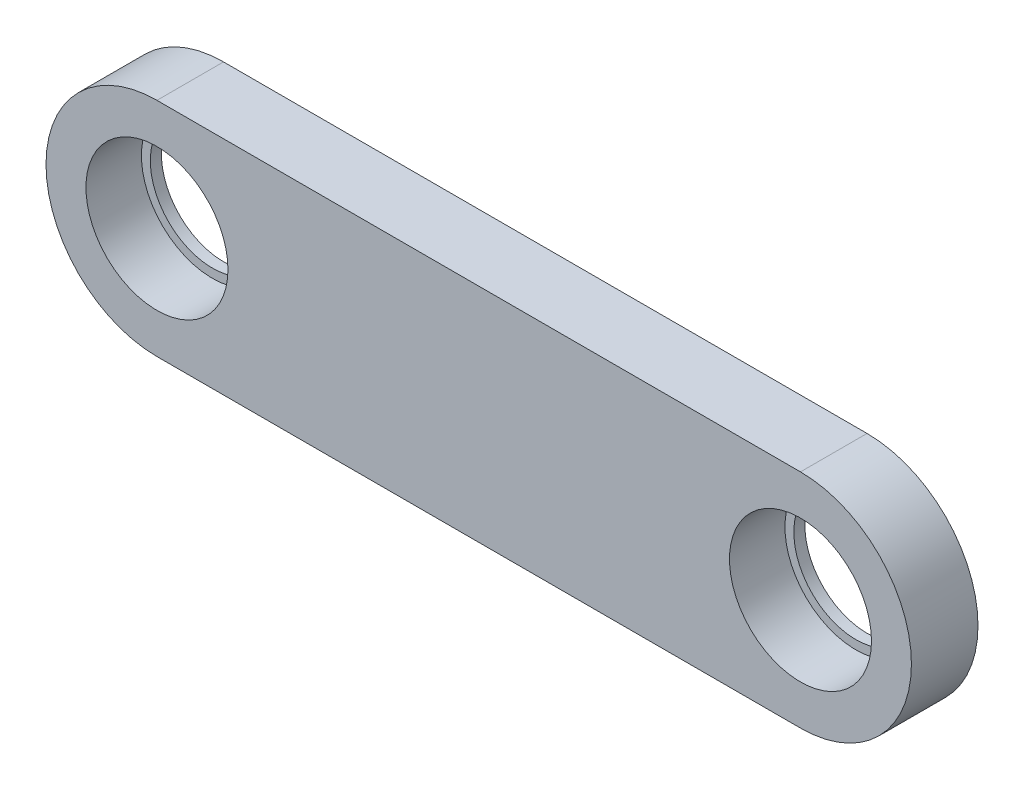
ISO-10303-21;
HEADER;
FILE_DESCRIPTION(('STEP AP214'),'2;1');
FILE_NAME('part.step','',(''),(''),'','','');
FILE_SCHEMA(('AUTOMOTIVE_DESIGN { 1 0 10303 214 1 1 1 1 }'));
ENDSEC;
DATA;
#1=APPLICATION_CONTEXT('core data for automotive mechanical design processes');
#2=APPLICATION_PROTOCOL_DEFINITION('international standard','automotive_design',2000,#1);
#3=PRODUCT_CONTEXT('',#1,'mechanical');
#4=PRODUCT('Part','Part','',(#3));
#5=PRODUCT_RELATED_PRODUCT_CATEGORY('part','',(#4));
#6=PRODUCT_DEFINITION_FORMATION('','',#4);
#7=PRODUCT_DEFINITION_CONTEXT('part definition',#1,'design');
#8=PRODUCT_DEFINITION('design','',#6,#7);
#9=PRODUCT_DEFINITION_SHAPE('','',#8);
#10=(LENGTH_UNIT() NAMED_UNIT(*) SI_UNIT(.MILLI.,.METRE.));
#11=(NAMED_UNIT(*) PLANE_ANGLE_UNIT() SI_UNIT($,.RADIAN.));
#12=(NAMED_UNIT(*) SI_UNIT($,.STERADIAN.) SOLID_ANGLE_UNIT());
#13=UNCERTAINTY_MEASURE_WITH_UNIT(LENGTH_MEASURE(1.E-05),#10,'distance_accuracy_value','');
#14=(GEOMETRIC_REPRESENTATION_CONTEXT(3) GLOBAL_UNCERTAINTY_ASSIGNED_CONTEXT((#13)) GLOBAL_UNIT_ASSIGNED_CONTEXT((#10,
#11,#12)) REPRESENTATION_CONTEXT('',''));
#15=CARTESIAN_POINT('',(0.,0.,0.));
#16=DIRECTION('',(0.,0.,1.));
#17=DIRECTION('',(1.,0.,0.));
#18=AXIS2_PLACEMENT_3D('',#15,#16,#17);
#19=CARTESIAN_POINT('',(-72.5,-1.24222922819225E-13,15.));
#20=DIRECTION('',(0.,0.,-1.));
#21=DIRECTION('',(-1.,0.,0.));
#22=AXIS2_PLACEMENT_3D('',#19,#20,#21);
#23=CYLINDRICAL_SURFACE('',#22,25.);
#24=CARTESIAN_POINT('',(-72.5,-1.24222922819225E-13,0.));
#25=DIRECTION('',(0.,0.,1.));
#26=DIRECTION('',(1.,0.,0.));
#27=AXIS2_PLACEMENT_3D('',#24,#25,#26);
#28=CIRCLE('',#27,25.);
#29=CARTESIAN_POINT('',(-72.5,24.9999999999999,0.));
#30=VERTEX_POINT('',#29);
#31=CARTESIAN_POINT('',(-72.5,-25.0000000000001,0.));
#32=VERTEX_POINT('',#31);
#33=EDGE_CURVE('E102',#30,#32,#28,.T.);
#34=ORIENTED_EDGE('',*,*,#33,.T.);
#35=DIRECTION('',(0.,0.,-1.));
#36=VECTOR('',#35,1.);
#37=CARTESIAN_POINT('',(-72.5,-25.0000000000001,15.));
#38=LINE('',#37,#36);
#39=CARTESIAN_POINT('',(-72.5,-25.0000000000001,15.));
#40=VERTEX_POINT('',#39);
#41=EDGE_CURVE('E11',#40,#32,#38,.T.);
#42=ORIENTED_EDGE('',*,*,#41,.F.);
#43=CARTESIAN_POINT('',(-72.5,-1.24222922819225E-13,15.));
#44=DIRECTION('',(0.,0.,1.));
#45=DIRECTION('',(1.,0.,0.));
#46=AXIS2_PLACEMENT_3D('',#43,#44,#45);
#47=CIRCLE('',#46,25.);
#48=CARTESIAN_POINT('',(-72.5,24.9999999999999,15.));
#49=VERTEX_POINT('',#48);
#50=EDGE_CURVE('E89',#49,#40,#47,.T.);
#51=ORIENTED_EDGE('',*,*,#50,.F.);
#52=DIRECTION('',(0.,0.,-1.));
#53=VECTOR('',#52,1.);
#54=CARTESIAN_POINT('',(-72.5,24.9999999999999,15.));
#55=LINE('',#54,#53);
#56=EDGE_CURVE('E98',#49,#30,#55,.T.);
#57=ORIENTED_EDGE('',*,*,#56,.T.);
#58=EDGE_LOOP('',(#34,#42,#51,#57));
#59=FACE_BOUND('',#58,.T.);
#60=ADVANCED_FACE('F36',(#59),#23,.T.);
#61=CARTESIAN_POINT('',(-72.5,-25.0000000000001,15.));
#62=DIRECTION('',(0.,1.,0.));
#63=DIRECTION('',(0.,0.,1.));
#64=AXIS2_PLACEMENT_3D('',#61,#62,#63);
#65=PLANE('',#64);
#66=DIRECTION('',(1.,0.,0.));
#67=VECTOR('',#66,1.);
#68=CARTESIAN_POINT('',(-72.5,-25.0000000000001,0.));
#69=LINE('',#68,#67);
#70=CARTESIAN_POINT('',(72.5,-25.0000000000001,0.));
#71=VERTEX_POINT('',#70);
#72=EDGE_CURVE('E93',#32,#71,#69,.T.);
#73=ORIENTED_EDGE('',*,*,#72,.T.);
#74=DIRECTION('',(0.,0.,-1.));
#75=VECTOR('',#74,1.);
#76=CARTESIAN_POINT('',(72.5,-25.0000000000001,15.));
#77=LINE('',#76,#75);
#78=CARTESIAN_POINT('',(72.5,-25.0000000000001,15.));
#79=VERTEX_POINT('',#78);
#80=EDGE_CURVE('E45',#79,#71,#77,.T.);
#81=ORIENTED_EDGE('',*,*,#80,.F.);
#82=DIRECTION('',(1.,0.,0.));
#83=VECTOR('',#82,1.);
#84=CARTESIAN_POINT('',(-72.5,-25.0000000000001,15.));
#85=LINE('',#84,#83);
#86=EDGE_CURVE('E84',#40,#79,#85,.T.);
#87=ORIENTED_EDGE('',*,*,#86,.F.);
#88=ORIENTED_EDGE('',*,*,#41,.T.);
#89=EDGE_LOOP('',(#73,#81,#87,#88));
#90=FACE_BOUND('',#89,.T.);
#91=ADVANCED_FACE('F92',(#90),#65,.F.);
#92=CARTESIAN_POINT('',(72.5,-1.24222922819225E-13,15.));
#93=DIRECTION('',(0.,0.,-1.));
#94=DIRECTION('',(-1.,0.,0.));
#95=AXIS2_PLACEMENT_3D('',#92,#93,#94);
#96=CYLINDRICAL_SURFACE('',#95,25.);
#97=CARTESIAN_POINT('',(72.5,-1.24222922819225E-13,0.));
#98=DIRECTION('',(0.,0.,1.));
#99=DIRECTION('',(1.,0.,0.));
#100=AXIS2_PLACEMENT_3D('',#97,#98,#99);
#101=CIRCLE('',#100,25.);
#102=CARTESIAN_POINT('',(72.5,24.9999999999999,0.));
#103=VERTEX_POINT('',#102);
#104=EDGE_CURVE('E71',#71,#103,#101,.T.);
#105=ORIENTED_EDGE('',*,*,#104,.T.);
#106=DIRECTION('',(0.,0.,-1.));
#107=VECTOR('',#106,1.);
#108=CARTESIAN_POINT('',(72.5,24.9999999999999,15.));
#109=LINE('',#108,#107);
#110=CARTESIAN_POINT('',(72.5,24.9999999999999,15.));
#111=VERTEX_POINT('',#110);
#112=EDGE_CURVE('E94',#111,#103,#109,.T.);
#113=ORIENTED_EDGE('',*,*,#112,.F.);
#114=CARTESIAN_POINT('',(72.5,-1.24222922819225E-13,15.));
#115=DIRECTION('',(0.,0.,1.));
#116=DIRECTION('',(1.,0.,0.));
#117=AXIS2_PLACEMENT_3D('',#114,#115,#116);
#118=CIRCLE('',#117,25.);
#119=EDGE_CURVE('E87',#79,#111,#118,.T.);
#120=ORIENTED_EDGE('',*,*,#119,.F.);
#121=ORIENTED_EDGE('',*,*,#80,.T.);
#122=EDGE_LOOP('',(#105,#113,#120,#121));
#123=FACE_BOUND('',#122,.T.);
#124=ADVANCED_FACE('F96',(#123),#96,.T.);
#125=CARTESIAN_POINT('',(-72.5,24.9999999999999,15.));
#126=DIRECTION('',(0.,-1.,0.));
#127=DIRECTION('',(0.,0.,-1.));
#128=AXIS2_PLACEMENT_3D('',#125,#126,#127);
#129=PLANE('',#128);
#130=DIRECTION('',(-1.,0.,0.));
#131=VECTOR('',#130,1.);
#132=CARTESIAN_POINT('',(-72.5,24.9999999999999,0.));
#133=LINE('',#132,#131);
#134=EDGE_CURVE('E77',#103,#30,#133,.T.);
#135=ORIENTED_EDGE('',*,*,#134,.T.);
#136=ORIENTED_EDGE('',*,*,#56,.F.);
#137=DIRECTION('',(-1.,0.,0.));
#138=VECTOR('',#137,1.);
#139=CARTESIAN_POINT('',(-72.5,24.9999999999999,15.));
#140=LINE('',#139,#138);
#141=EDGE_CURVE('E54',#111,#49,#140,.T.);
#142=ORIENTED_EDGE('',*,*,#141,.F.);
#143=ORIENTED_EDGE('',*,*,#112,.T.);
#144=EDGE_LOOP('',(#135,#136,#142,#143));
#145=FACE_BOUND('',#144,.T.);
#146=ADVANCED_FACE('F139',(#145),#129,.F.);
#147=CARTESIAN_POINT('',(-72.5,-1.24222922819225E-13,15.));
#148=DIRECTION('',(0.,0.,1.));
#149=DIRECTION('',(1.,0.,0.));
#150=AXIS2_PLACEMENT_3D('',#147,#148,#149);
#151=PLANE('',#150);
#152=CARTESIAN_POINT('',(72.5,-1.2490009027033E-13,15.));
#153=DIRECTION('',(0.,0.,1.));
#154=DIRECTION('',(1.,0.,0.));
#155=AXIS2_PLACEMENT_3D('',#152,#153,#154);
#156=CIRCLE('',#155,16.);
#157=CARTESIAN_POINT('',(88.5,-1.2490009027033E-13,15.));
#158=VERTEX_POINT('',#157);
#159=EDGE_CURVE('E112',#158,#158,#156,.T.);
#160=ORIENTED_EDGE('',*,*,#159,.F.);
#161=EDGE_LOOP('',(#160));
#162=FACE_BOUND('',#161,.T.);
#163=CARTESIAN_POINT('',(-72.5,-1.2490009027033E-13,15.));
#164=DIRECTION('',(0.,0.,1.));
#165=DIRECTION('',(1.,0.,0.));
#166=AXIS2_PLACEMENT_3D('',#163,#164,#165);
#167=CIRCLE('',#166,16.);
#168=CARTESIAN_POINT('',(-56.5,-1.2490009027033E-13,15.));
#169=VERTEX_POINT('',#168);
#170=EDGE_CURVE('E128',#169,#169,#167,.T.);
#171=ORIENTED_EDGE('',*,*,#170,.F.);
#172=EDGE_LOOP('',(#171));
#173=FACE_BOUND('',#172,.T.);
#174=ORIENTED_EDGE('',*,*,#50,.T.);
#175=ORIENTED_EDGE('',*,*,#86,.T.);
#176=ORIENTED_EDGE('',*,*,#119,.T.);
#177=ORIENTED_EDGE('',*,*,#141,.T.);
#178=EDGE_LOOP('',(#174,#175,#176,#177));
#179=FACE_BOUND('',#178,.T.);
#180=ADVANCED_FACE('F85',(#162,#173,#179),#151,.T.);
#181=CARTESIAN_POINT('',(-72.5,-1.24222922819225E-13,0.));
#182=DIRECTION('',(0.,0.,1.));
#183=DIRECTION('',(1.,0.,0.));
#184=AXIS2_PLACEMENT_3D('',#181,#182,#183);
#185=PLANE('',#184);
#186=CARTESIAN_POINT('',(72.5,-1.2490009027033E-13,0.));
#187=DIRECTION('',(0.,0.,1.));
#188=DIRECTION('',(1.,0.,0.));
#189=AXIS2_PLACEMENT_3D('',#186,#187,#188);
#190=CIRCLE('',#189,14.);
#191=CARTESIAN_POINT('',(86.5,-1.2490009027033E-13,0.));
#192=VERTEX_POINT('',#191);
#193=EDGE_CURVE('E124',#192,#192,#190,.T.);
#194=ORIENTED_EDGE('',*,*,#193,.T.);
#195=EDGE_LOOP('',(#194));
#196=FACE_BOUND('',#195,.T.);
#197=CARTESIAN_POINT('',(-72.5,-1.2490009027033E-13,0.));
#198=DIRECTION('',(0.,0.,1.));
#199=DIRECTION('',(1.,0.,0.));
#200=AXIS2_PLACEMENT_3D('',#197,#198,#199);
#201=CIRCLE('',#200,14.);
#202=CARTESIAN_POINT('',(-58.5,-1.2490009027033E-13,0.));
#203=VERTEX_POINT('',#202);
#204=EDGE_CURVE('E113',#203,#203,#201,.T.);
#205=ORIENTED_EDGE('',*,*,#204,.T.);
#206=EDGE_LOOP('',(#205));
#207=FACE_BOUND('',#206,.T.);
#208=ORIENTED_EDGE('',*,*,#33,.F.);
#209=ORIENTED_EDGE('',*,*,#134,.F.);
#210=ORIENTED_EDGE('',*,*,#104,.F.);
#211=ORIENTED_EDGE('',*,*,#72,.F.);
#212=EDGE_LOOP('',(#208,#209,#210,#211));
#213=FACE_BOUND('',#212,.T.);
#214=ADVANCED_FACE('F138',(#196,#207,#213),#185,.F.);
#215=CARTESIAN_POINT('',(-72.5,-1.2490009027033E-13,2.5));
#216=DIRECTION('',(0.,0.,1.));
#217=DIRECTION('',(1.,0.,0.));
#218=AXIS2_PLACEMENT_3D('',#215,#216,#217);
#219=CYLINDRICAL_SURFACE('',#218,16.);
#220=CARTESIAN_POINT('',(-72.5,-1.2490009027033E-13,2.5));
#221=DIRECTION('',(0.,0.,1.));
#222=DIRECTION('',(1.,0.,0.));
#223=AXIS2_PLACEMENT_3D('',#220,#221,#222);
#224=CIRCLE('',#223,16.);
#225=CARTESIAN_POINT('',(-56.5,-1.2490009027033E-13,2.5));
#226=VERTEX_POINT('',#225);
#227=EDGE_CURVE('E105',#226,#226,#224,.T.);
#228=ORIENTED_EDGE('',*,*,#227,.F.);
#229=EDGE_LOOP('',(#228));
#230=FACE_BOUND('',#229,.T.);
#231=ORIENTED_EDGE('',*,*,#170,.T.);
#232=EDGE_LOOP('',(#231));
#233=FACE_BOUND('',#232,.T.);
#234=ADVANCED_FACE('F135',(#230,#233),#219,.F.);
#235=CARTESIAN_POINT('',(-72.5,-1.2490009027033E-13,2.5));
#236=DIRECTION('',(0.,0.,1.));
#237=DIRECTION('',(1.,0.,0.));
#238=AXIS2_PLACEMENT_3D('',#235,#236,#237);
#239=PLANE('',#238);
#240=CARTESIAN_POINT('',(-72.5,-1.2490009027033E-13,2.5));
#241=DIRECTION('',(0.,0.,1.));
#242=DIRECTION('',(1.,0.,0.));
#243=AXIS2_PLACEMENT_3D('',#240,#241,#242);
#244=CIRCLE('',#243,14.);
#245=CARTESIAN_POINT('',(-58.5,-1.2490009027033E-13,2.5));
#246=VERTEX_POINT('',#245);
#247=EDGE_CURVE('E110',#246,#246,#244,.T.);
#248=ORIENTED_EDGE('',*,*,#247,.F.);
#249=EDGE_LOOP('',(#248));
#250=FACE_BOUND('',#249,.T.);
#251=ORIENTED_EDGE('',*,*,#227,.T.);
#252=EDGE_LOOP('',(#251));
#253=FACE_BOUND('',#252,.T.);
#254=ADVANCED_FACE('F182',(#250,#253),#239,.T.);
#255=CARTESIAN_POINT('',(72.5,-1.2490009027033E-13,2.5));
#256=DIRECTION('',(0.,0.,1.));
#257=DIRECTION('',(1.,0.,0.));
#258=AXIS2_PLACEMENT_3D('',#255,#256,#257);
#259=CYLINDRICAL_SURFACE('',#258,16.);
#260=CARTESIAN_POINT('',(72.5,-1.2490009027033E-13,2.5));
#261=DIRECTION('',(0.,0.,1.));
#262=DIRECTION('',(1.,0.,0.));
#263=AXIS2_PLACEMENT_3D('',#260,#261,#262);
#264=CIRCLE('',#263,16.);
#265=CARTESIAN_POINT('',(88.5,-1.2490009027033E-13,2.5));
#266=VERTEX_POINT('',#265);
#267=EDGE_CURVE('E117',#266,#266,#264,.T.);
#268=ORIENTED_EDGE('',*,*,#267,.F.);
#269=EDGE_LOOP('',(#268));
#270=FACE_BOUND('',#269,.T.);
#271=ORIENTED_EDGE('',*,*,#159,.T.);
#272=EDGE_LOOP('',(#271));
#273=FACE_BOUND('',#272,.T.);
#274=ADVANCED_FACE('F189',(#270,#273),#259,.F.);
#275=CARTESIAN_POINT('',(72.5,-1.2490009027033E-13,2.5));
#276=DIRECTION('',(0.,0.,1.));
#277=DIRECTION('',(1.,0.,0.));
#278=AXIS2_PLACEMENT_3D('',#275,#276,#277);
#279=PLANE('',#278);
#280=CARTESIAN_POINT('',(72.5,-1.2490009027033E-13,2.5));
#281=DIRECTION('',(0.,0.,1.));
#282=DIRECTION('',(1.,0.,0.));
#283=AXIS2_PLACEMENT_3D('',#280,#281,#282);
#284=CIRCLE('',#283,14.);
#285=CARTESIAN_POINT('',(86.5,-1.2490009027033E-13,2.5));
#286=VERTEX_POINT('',#285);
#287=EDGE_CURVE('E39',#286,#286,#284,.T.);
#288=ORIENTED_EDGE('',*,*,#287,.F.);
#289=EDGE_LOOP('',(#288));
#290=FACE_BOUND('',#289,.T.);
#291=ORIENTED_EDGE('',*,*,#267,.T.);
#292=EDGE_LOOP('',(#291));
#293=FACE_BOUND('',#292,.T.);
#294=ADVANCED_FACE('F194',(#290,#293),#279,.T.);
#295=CARTESIAN_POINT('',(-72.5,-1.2490009027033E-13,0.));
#296=DIRECTION('',(0.,0.,1.));
#297=DIRECTION('',(1.,0.,0.));
#298=AXIS2_PLACEMENT_3D('',#295,#296,#297);
#299=CYLINDRICAL_SURFACE('',#298,14.);
#300=ORIENTED_EDGE('',*,*,#247,.T.);
#301=EDGE_LOOP('',(#300));
#302=FACE_BOUND('',#301,.T.);
#303=ORIENTED_EDGE('',*,*,#204,.F.);
#304=EDGE_LOOP('',(#303));
#305=FACE_BOUND('',#304,.T.);
#306=ADVANCED_FACE('F216',(#302,#305),#299,.F.);
#307=CARTESIAN_POINT('',(72.5,-1.2490009027033E-13,0.));
#308=DIRECTION('',(0.,0.,1.));
#309=DIRECTION('',(1.,0.,0.));
#310=AXIS2_PLACEMENT_3D('',#307,#308,#309);
#311=CYLINDRICAL_SURFACE('',#310,14.);
#312=ORIENTED_EDGE('',*,*,#287,.T.);
#313=EDGE_LOOP('',(#312));
#314=FACE_BOUND('',#313,.T.);
#315=ORIENTED_EDGE('',*,*,#193,.F.);
#316=EDGE_LOOP('',(#315));
#317=FACE_BOUND('',#316,.T.);
#318=ADVANCED_FACE('F226',(#314,#317),#311,.F.);
#319=CLOSED_SHELL('',(#60,#91,#124,#146,#180,#214,#234,#254,#274,#294,#306,#318));
#320=MANIFOLD_SOLID_BREP('B2',#319);
#321=ADVANCED_BREP_SHAPE_REPRESENTATION('',(#18,#320),#14);
#322=SHAPE_DEFINITION_REPRESENTATION(#9,#321);
ENDSEC;
END-ISO-10303-21;
